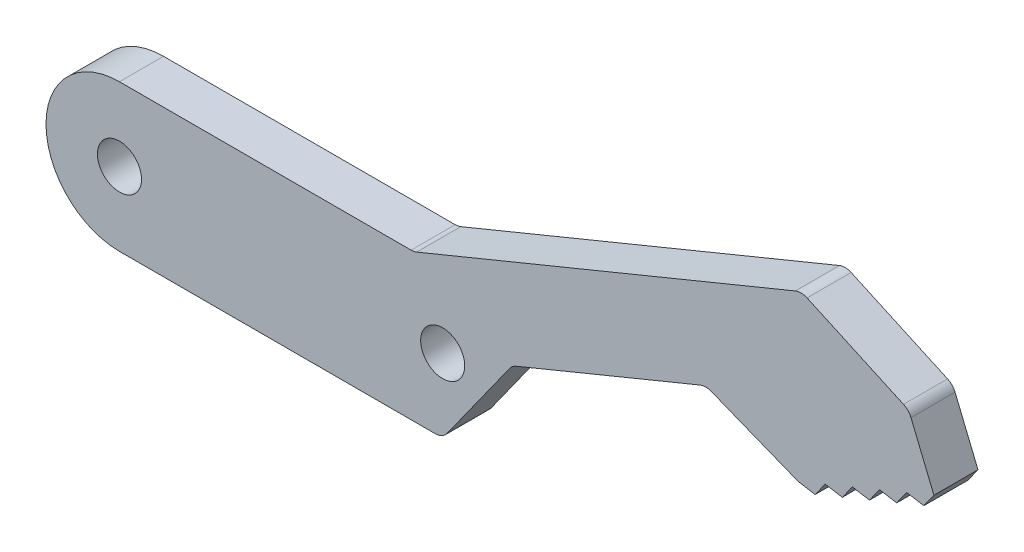
ISO-10303-21;
HEADER;
FILE_DESCRIPTION(('STEP AP214'),'2;1');
FILE_NAME('part.step','',(''),(''),'','','');
FILE_SCHEMA(('AUTOMOTIVE_DESIGN { 1 0 10303 214 1 1 1 1 }'));
ENDSEC;
DATA;
#1=APPLICATION_CONTEXT('core data for automotive mechanical design processes');
#2=APPLICATION_PROTOCOL_DEFINITION('international standard','automotive_design',2000,#1);
#3=PRODUCT_CONTEXT('',#1,'mechanical');
#4=PRODUCT('Part','Part','',(#3));
#5=PRODUCT_RELATED_PRODUCT_CATEGORY('part','',(#4));
#6=PRODUCT_DEFINITION_FORMATION('','',#4);
#7=PRODUCT_DEFINITION_CONTEXT('part definition',#1,'design');
#8=PRODUCT_DEFINITION('design','',#6,#7);
#9=PRODUCT_DEFINITION_SHAPE('','',#8);
#10=(LENGTH_UNIT() NAMED_UNIT(*) SI_UNIT(.MILLI.,.METRE.));
#11=(NAMED_UNIT(*) PLANE_ANGLE_UNIT() SI_UNIT($,.RADIAN.));
#12=(NAMED_UNIT(*) SI_UNIT($,.STERADIAN.) SOLID_ANGLE_UNIT());
#13=UNCERTAINTY_MEASURE_WITH_UNIT(LENGTH_MEASURE(1.E-05),#10,'distance_accuracy_value','');
#14=(GEOMETRIC_REPRESENTATION_CONTEXT(3) GLOBAL_UNCERTAINTY_ASSIGNED_CONTEXT((#13)) GLOBAL_UNIT_ASSIGNED_CONTEXT((#10,
#11,#12)) REPRESENTATION_CONTEXT('',''));
#15=CARTESIAN_POINT('',(0.,0.,0.));
#16=DIRECTION('',(0.,0.,1.));
#17=DIRECTION('',(1.,0.,0.));
#18=AXIS2_PLACEMENT_3D('',#15,#16,#17);
#19=CARTESIAN_POINT('',(7.89764564460258,-4.,3.));
#20=DIRECTION('',(0.,0.,1.));
#21=DIRECTION('',(1.,0.,0.));
#22=AXIS2_PLACEMENT_3D('',#19,#20,#21);
#23=CYLINDRICAL_SURFACE('',#22,1.);
#24=CARTESIAN_POINT('',(7.89764564460258,-4.,3.));
#25=DIRECTION('',(0.,0.,1.));
#26=DIRECTION('',(1.,0.,0.));
#27=AXIS2_PLACEMENT_3D('',#24,#25,#26);
#28=CIRCLE('',#27,1.);
#29=CARTESIAN_POINT('',(7.89764564460258,-5.,3.));
#30=VERTEX_POINT('',#29);
#31=CARTESIAN_POINT('',(8.71134887825418,-4.58128052396835,3.));
#32=VERTEX_POINT('',#31);
#33=EDGE_CURVE('E37',#30,#32,#28,.T.);
#34=ORIENTED_EDGE('',*,*,#33,.F.);
#35=DIRECTION('',(0.,0.,1.));
#36=VECTOR('',#35,1.);
#37=CARTESIAN_POINT('',(7.89764564460258,-5.,3.));
#38=LINE('',#37,#36);
#39=CARTESIAN_POINT('',(7.89764564460258,-5.,0.));
#40=VERTEX_POINT('',#39);
#41=EDGE_CURVE('E454',#40,#30,#38,.T.);
#42=ORIENTED_EDGE('',*,*,#41,.F.);
#43=CARTESIAN_POINT('',(7.89764564460258,-4.,0.));
#44=DIRECTION('',(0.,0.,-1.));
#45=DIRECTION('',(1.,0.,0.));
#46=AXIS2_PLACEMENT_3D('',#43,#44,#45);
#47=CIRCLE('',#46,1.);
#48=CARTESIAN_POINT('',(8.71134887825418,-4.58128052396835,0.));
#49=VERTEX_POINT('',#48);
#50=EDGE_CURVE('E47',#49,#40,#47,.T.);
#51=ORIENTED_EDGE('',*,*,#50,.F.);
#52=DIRECTION('',(0.,0.,-1.));
#53=VECTOR('',#52,1.);
#54=CARTESIAN_POINT('',(8.71134887825418,-4.58128052396835,0.));
#55=LINE('',#54,#53);
#56=EDGE_CURVE('E279',#32,#49,#55,.T.);
#57=ORIENTED_EDGE('',*,*,#56,.F.);
#58=EDGE_LOOP('',(#34,#42,#51,#57));
#59=FACE_BOUND('',#58,.T.);
#60=ADVANCED_FACE('F17',(#59),#23,.T.);
#61=CARTESIAN_POINT('',(13.7885523682827,0.805682858816311,3.));
#62=DIRECTION('',(0.,0.,1.));
#63=DIRECTION('',(1.,0.,0.));
#64=AXIS2_PLACEMENT_3D('',#61,#62,#63);
#65=CYLINDRICAL_SURFACE('',#64,1.);
#66=CARTESIAN_POINT('',(13.7885523682827,0.805682858816311,3.));
#67=DIRECTION('',(0.,0.,-1.));
#68=DIRECTION('',(1.,0.,0.));
#69=AXIS2_PLACEMENT_3D('',#66,#67,#68);
#70=CIRCLE('',#69,1.);
#71=CARTESIAN_POINT('',(12.9748491346311,1.38696338278467,3.));
#72=VERTEX_POINT('',#71);
#73=CARTESIAN_POINT('',(13.4082889555495,1.73056108698286,3.));
#74=VERTEX_POINT('',#73);
#75=EDGE_CURVE('E270',#72,#74,#70,.T.);
#76=ORIENTED_EDGE('',*,*,#75,.F.);
#77=DIRECTION('',(0.,0.,1.));
#78=VECTOR('',#77,1.);
#79=CARTESIAN_POINT('',(12.9748491346311,1.38696338278466,3.));
#80=LINE('',#79,#78);
#81=CARTESIAN_POINT('',(12.9748491346311,1.38696338278467,0.));
#82=VERTEX_POINT('',#81);
#83=EDGE_CURVE('E268',#82,#72,#80,.T.);
#84=ORIENTED_EDGE('',*,*,#83,.F.);
#85=CARTESIAN_POINT('',(13.7885523682827,0.805682858816311,0.));
#86=DIRECTION('',(0.,0.,1.));
#87=DIRECTION('',(1.,0.,0.));
#88=AXIS2_PLACEMENT_3D('',#85,#86,#87);
#89=CIRCLE('',#88,1.);
#90=CARTESIAN_POINT('',(13.4082889555495,1.73056108698286,0.));
#91=VERTEX_POINT('',#90);
#92=EDGE_CURVE('E253',#91,#82,#89,.T.);
#93=ORIENTED_EDGE('',*,*,#92,.F.);
#94=DIRECTION('',(0.,0.,-1.));
#95=VECTOR('',#94,1.);
#96=CARTESIAN_POINT('',(13.4082889555495,1.73056108698286,0.));
#97=LINE('',#96,#95);
#98=EDGE_CURVE('E315',#74,#91,#97,.T.);
#99=ORIENTED_EDGE('',*,*,#98,.F.);
#100=EDGE_LOOP('',(#76,#84,#93,#99));
#101=FACE_BOUND('',#100,.T.);
#102=ADVANCED_FACE('F269',(#101),#65,.F.);
#103=CARTESIAN_POINT('',(26.3189833836422,5.95756590223529,3.));
#104=DIRECTION('',(0.,0.,1.));
#105=DIRECTION('',(1.,0.,0.));
#106=AXIS2_PLACEMENT_3D('',#103,#104,#105);
#107=CYLINDRICAL_SURFACE('',#106,1.);
#108=CARTESIAN_POINT('',(26.3189833836422,5.95756590223529,3.));
#109=DIRECTION('',(0.,0.,-1.));
#110=DIRECTION('',(1.,0.,0.));
#111=AXIS2_PLACEMENT_3D('',#108,#109,#110);
#112=CIRCLE('',#111,1.);
#113=CARTESIAN_POINT('',(25.938719970909,6.88244413040184,3.));
#114=VERTEX_POINT('',#113);
#115=CARTESIAN_POINT('',(26.6879191791018,6.8870207848566,3.));
#116=VERTEX_POINT('',#115);
#117=EDGE_CURVE('E407',#114,#116,#112,.T.);
#118=ORIENTED_EDGE('',*,*,#117,.F.);
#119=DIRECTION('',(0.,0.,1.));
#120=VECTOR('',#119,1.);
#121=CARTESIAN_POINT('',(25.938719970909,6.88244413040184,3.));
#122=LINE('',#121,#120);
#123=CARTESIAN_POINT('',(25.938719970909,6.88244413040184,0.));
#124=VERTEX_POINT('',#123);
#125=EDGE_CURVE('E515',#124,#114,#122,.T.);
#126=ORIENTED_EDGE('',*,*,#125,.F.);
#127=CARTESIAN_POINT('',(26.3189833836422,5.95756590223529,0.));
#128=DIRECTION('',(0.,0.,1.));
#129=DIRECTION('',(1.,0.,0.));
#130=AXIS2_PLACEMENT_3D('',#127,#128,#129);
#131=CIRCLE('',#130,1.);
#132=CARTESIAN_POINT('',(26.6879191791018,6.8870207848566,0.));
#133=VERTEX_POINT('',#132);
#134=EDGE_CURVE('E265',#133,#124,#131,.T.);
#135=ORIENTED_EDGE('',*,*,#134,.F.);
#136=DIRECTION('',(0.,0.,-1.));
#137=VECTOR('',#136,1.);
#138=CARTESIAN_POINT('',(26.6879191791018,6.88702078485661,0.));
#139=LINE('',#138,#137);
#140=EDGE_CURVE('E305',#116,#133,#139,.T.);
#141=ORIENTED_EDGE('',*,*,#140,.F.);
#142=EDGE_LOOP('',(#118,#126,#135,#141));
#143=FACE_BOUND('',#142,.T.);
#144=ADVANCED_FACE('F590',(#143),#107,.F.);
#145=CARTESIAN_POINT('',(6.26467870963807,6.,3.));
#146=DIRECTION('',(0.,0.,1.));
#147=DIRECTION('',(1.,0.,0.));
#148=AXIS2_PLACEMENT_3D('',#145,#146,#147);
#149=CYLINDRICAL_SURFACE('',#148,1.);
#150=CARTESIAN_POINT('',(6.26467870963807,6.,3.));
#151=DIRECTION('',(0.,0.,-1.));
#152=DIRECTION('',(1.,0.,0.));
#153=AXIS2_PLACEMENT_3D('',#150,#151,#152);
#154=CIRCLE('',#153,1.);
#155=CARTESIAN_POINT('',(6.64494212237128,5.07512177183345,3.));
#156=VERTEX_POINT('',#155);
#157=CARTESIAN_POINT('',(6.26467870963807,5.,3.));
#158=VERTEX_POINT('',#157);
#159=EDGE_CURVE('E500',#156,#158,#154,.T.);
#160=ORIENTED_EDGE('',*,*,#159,.F.);
#161=DIRECTION('',(0.,0.,1.));
#162=VECTOR('',#161,1.);
#163=CARTESIAN_POINT('',(6.64494212237128,5.07512177183345,3.));
#164=LINE('',#163,#162);
#165=CARTESIAN_POINT('',(6.64494212237128,5.07512177183345,0.));
#166=VERTEX_POINT('',#165);
#167=EDGE_CURVE('E353',#166,#156,#164,.T.);
#168=ORIENTED_EDGE('',*,*,#167,.F.);
#169=CARTESIAN_POINT('',(6.26467870963807,6.,0.));
#170=DIRECTION('',(0.,0.,1.));
#171=DIRECTION('',(1.,0.,0.));
#172=AXIS2_PLACEMENT_3D('',#169,#170,#171);
#173=CIRCLE('',#172,1.);
#174=CARTESIAN_POINT('',(6.26467870963807,5.,0.));
#175=VERTEX_POINT('',#174);
#176=EDGE_CURVE('E25',#175,#166,#173,.T.);
#177=ORIENTED_EDGE('',*,*,#176,.F.);
#178=DIRECTION('',(0.,0.,-1.));
#179=VECTOR('',#178,1.);
#180=CARTESIAN_POINT('',(6.26467870963807,5.,0.));
#181=LINE('',#180,#179);
#182=EDGE_CURVE('E423',#158,#175,#181,.T.);
#183=ORIENTED_EDGE('',*,*,#182,.F.);
#184=EDGE_LOOP('',(#160,#168,#177,#183));
#185=FACE_BOUND('',#184,.T.);
#186=ADVANCED_FACE('F526',(#185),#149,.F.);
#187=CARTESIAN_POINT('',(32.8009169878943,14.7479197611021,3.));
#188=DIRECTION('',(0.,0.,-1.));
#189=DIRECTION('',(-1.,0.,0.));
#190=AXIS2_PLACEMENT_3D('',#187,#188,#189);
#191=CYLINDRICAL_SURFACE('',#190,1.);
#192=CARTESIAN_POINT('',(32.8009169878943,14.7479197611021,3.));
#193=DIRECTION('',(0.,0.,1.));
#194=DIRECTION('',(1.,0.,0.));
#195=AXIS2_PLACEMENT_3D('',#192,#193,#194);
#196=CIRCLE('',#195,1.);
#197=CARTESIAN_POINT('',(33.2154392478264,15.6579589338968,3.));
#198=VERTEX_POINT('',#197);
#199=CARTESIAN_POINT('',(32.4206535751611,15.6727979892687,3.));
#200=VERTEX_POINT('',#199);
#201=EDGE_CURVE('E492',#198,#200,#196,.T.);
#202=ORIENTED_EDGE('',*,*,#201,.F.);
#203=DIRECTION('',(0.,0.,1.));
#204=VECTOR('',#203,1.);
#205=CARTESIAN_POINT('',(33.2154392478264,15.6579589338968,3.));
#206=LINE('',#205,#204);
#207=CARTESIAN_POINT('',(33.2154392478264,15.6579589338968,0.));
#208=VERTEX_POINT('',#207);
#209=EDGE_CURVE('E292',#208,#198,#206,.T.);
#210=ORIENTED_EDGE('',*,*,#209,.F.);
#211=CARTESIAN_POINT('',(32.8009169878943,14.7479197611021,0.));
#212=DIRECTION('',(0.,0.,-1.));
#213=DIRECTION('',(1.,0.,0.));
#214=AXIS2_PLACEMENT_3D('',#211,#212,#213);
#215=CIRCLE('',#214,1.);
#216=CARTESIAN_POINT('',(32.4206535751611,15.6727979892687,0.));
#217=VERTEX_POINT('',#216);
#218=EDGE_CURVE('E11',#217,#208,#215,.T.);
#219=ORIENTED_EDGE('',*,*,#218,.F.);
#220=DIRECTION('',(0.,0.,-1.));
#221=VECTOR('',#220,1.);
#222=CARTESIAN_POINT('',(32.4206535751611,15.6727979892687,3.));
#223=LINE('',#222,#221);
#224=EDGE_CURVE('E483',#200,#217,#223,.T.);
#225=ORIENTED_EDGE('',*,*,#224,.F.);
#226=EDGE_LOOP('',(#202,#210,#219,#225));
#227=FACE_BOUND('',#226,.T.);
#228=ADVANCED_FACE('F535',(#227),#191,.T.);
#229=CARTESIAN_POINT('',(39.3638437130892,11.7585108441848,3.));
#230=DIRECTION('',(0.,0.,-1.));
#231=DIRECTION('',(-1.,0.,0.));
#232=AXIS2_PLACEMENT_3D('',#229,#230,#231);
#233=CYLINDRICAL_SURFACE('',#232,1.);
#234=CARTESIAN_POINT('',(39.3638437130892,11.7585108441848,3.));
#235=DIRECTION('',(0.,0.,1.));
#236=DIRECTION('',(1.,0.,0.));
#237=AXIS2_PLACEMENT_3D('',#234,#235,#236);
#238=CIRCLE('',#237,1.);
#239=CARTESIAN_POINT('',(40.2887219412557,12.138774256918,3.));
#240=VERTEX_POINT('',#239);
#241=CARTESIAN_POINT('',(39.7783659730213,12.6685500169795,3.));
#242=VERTEX_POINT('',#241);
#243=EDGE_CURVE('E453',#240,#242,#238,.T.);
#244=ORIENTED_EDGE('',*,*,#243,.F.);
#245=DIRECTION('',(0.,0.,1.));
#246=VECTOR('',#245,1.);
#247=CARTESIAN_POINT('',(40.2887219412557,12.138774256918,3.));
#248=LINE('',#247,#246);
#249=CARTESIAN_POINT('',(40.2887219412557,12.138774256918,0.));
#250=VERTEX_POINT('',#249);
#251=EDGE_CURVE('E471',#250,#240,#248,.T.);
#252=ORIENTED_EDGE('',*,*,#251,.F.);
#253=CARTESIAN_POINT('',(39.3638437130892,11.7585108441848,0.));
#254=DIRECTION('',(0.,0.,-1.));
#255=DIRECTION('',(1.,0.,0.));
#256=AXIS2_PLACEMENT_3D('',#253,#254,#255);
#257=CIRCLE('',#256,1.);
#258=CARTESIAN_POINT('',(39.7783659730213,12.6685500169795,0.));
#259=VERTEX_POINT('',#258);
#260=EDGE_CURVE('E404',#259,#250,#257,.T.);
#261=ORIENTED_EDGE('',*,*,#260,.F.);
#262=DIRECTION('',(0.,0.,-1.));
#263=VECTOR('',#262,1.);
#264=CARTESIAN_POINT('',(39.7783659730212,12.6685500169795,3.));
#265=LINE('',#264,#263);
#266=EDGE_CURVE('E385',#242,#259,#265,.T.);
#267=ORIENTED_EDGE('',*,*,#266,.F.);
#268=EDGE_LOOP('',(#244,#252,#261,#267));
#269=FACE_BOUND('',#268,.T.);
#270=ADVANCED_FACE('F540',(#269),#233,.T.);
#271=CARTESIAN_POINT('',(0.,0.,0.));
#272=DIRECTION('',(0.,0.,1.));
#273=DIRECTION('',(1.,0.,0.));
#274=AXIS2_PLACEMENT_3D('',#271,#272,#273);
#275=PLANE('',#274);
#276=CARTESIAN_POINT('',(8.41223064158309,0.,0.));
#277=DIRECTION('',(0.,0.,1.));
#278=DIRECTION('',(1.,0.,0.));
#279=AXIS2_PLACEMENT_3D('',#276,#277,#278);
#280=CIRCLE('',#279,1.5);
#281=CARTESIAN_POINT('',(9.91223064158309,0.,0.));
#282=VERTEX_POINT('',#281);
#283=EDGE_CURVE('E626',#282,#282,#280,.T.);
#284=ORIENTED_EDGE('',*,*,#283,.T.);
#285=EDGE_LOOP('',(#284));
#286=FACE_BOUND('',#285,.T.);
#287=CARTESIAN_POINT('',(-13.5877693584169,0.,0.));
#288=DIRECTION('',(0.,0.,1.));
#289=DIRECTION('',(1.,0.,0.));
#290=AXIS2_PLACEMENT_3D('',#287,#288,#289);
#291=CIRCLE('',#290,1.5);
#292=CARTESIAN_POINT('',(-12.0877693584169,0.,0.));
#293=VERTEX_POINT('',#292);
#294=EDGE_CURVE('E612',#293,#293,#291,.T.);
#295=ORIENTED_EDGE('',*,*,#294,.T.);
#296=EDGE_LOOP('',(#295));
#297=FACE_BOUND('',#296,.T.);
#298=DIRECTION('',(0.910039172794664,-0.414522259932086,0.));
#299=VECTOR('',#298,1.);
#300=CARTESIAN_POINT('',(11.6140411280332,25.4973819323723,0.));
#301=LINE('',#300,#299);
#302=EDGE_CURVE('E477',#208,#259,#301,.T.);
#303=ORIENTED_EDGE('',*,*,#302,.T.);
#304=ORIENTED_EDGE('',*,*,#260,.T.);
#305=DIRECTION('',(0.380263412733207,-0.924878228166549,0.));
#306=VECTOR('',#305,1.);
#307=CARTESIAN_POINT('',(38.7321369055221,15.9247067490612,0.));
#308=LINE('',#307,#306);
#309=CARTESIAN_POINT('',(41.8495009486289,8.34264116979486,0.));
#310=VERTEX_POINT('',#309);
#311=EDGE_CURVE('E468',#250,#310,#308,.T.);
#312=ORIENTED_EDGE('',*,*,#311,.T.);
#313=DIRECTION('',(0.582755963225876,0.812647209633234,0.));
#314=VECTOR('',#313,1.);
#315=CARTESIAN_POINT('',(23.6863552194379,-16.9856791330688,0.));
#316=LINE('',#315,#314);
#317=CARTESIAN_POINT('',(41.1622873534206,7.38432886445756,0.));
#318=VERTEX_POINT('',#317);
#319=EDGE_CURVE('E294',#318,#310,#316,.T.);
#320=ORIENTED_EDGE('',*,*,#319,.F.);
#321=DIRECTION('',(0.985834374567057,-0.167721751487336,0.));
#322=VECTOR('',#321,1.);
#323=CARTESIAN_POINT('',(2.37888752667533,13.9826174973043,0.));
#324=LINE('',#323,#322);
#325=CARTESIAN_POINT('',(39.9997444922958,7.58211434432844,0.));
#326=VERTEX_POINT('',#325);
#327=EDGE_CURVE('E449',#326,#318,#324,.T.);
#328=ORIENTED_EDGE('',*,*,#327,.F.);
#329=DIRECTION('',(0.582755963225879,0.812647209633232,0.));
#330=VECTOR('',#329,1.);
#331=CARTESIAN_POINT('',(22.8249509000335,-16.3679590474883,0.));
#332=LINE('',#331,#330);
#333=CARTESIAN_POINT('',(39.3125308970875,6.62380203899114,0.));
#334=VERTEX_POINT('',#333);
#335=EDGE_CURVE('E434',#334,#326,#332,.T.);
#336=ORIENTED_EDGE('',*,*,#335,.F.);
#337=DIRECTION('',(0.985834374567056,-0.167721751487343,0.));
#338=VECTOR('',#337,1.);
#339=CARTESIAN_POINT('',(2.20110282566793,12.937635150226,0.));
#340=LINE('',#339,#338);
#341=CARTESIAN_POINT('',(38.1499880359627,6.82158751886202,0.));
#342=VERTEX_POINT('',#341);
#343=EDGE_CURVE('E337',#342,#334,#340,.T.);
#344=ORIENTED_EDGE('',*,*,#343,.F.);
#345=DIRECTION('',(0.582755963225876,0.812647209633234,0.));
#346=VECTOR('',#345,1.);
#347=CARTESIAN_POINT('',(21.9635465806293,-15.7502389619078,0.));
#348=LINE('',#347,#346);
#349=CARTESIAN_POINT('',(37.4627744407544,5.86327521352473,0.));
#350=VERTEX_POINT('',#349);
#351=EDGE_CURVE('E376',#350,#342,#348,.T.);
#352=ORIENTED_EDGE('',*,*,#351,.F.);
#353=DIRECTION('',(0.985834374567056,-0.167721751487343,0.));
#354=VECTOR('',#353,1.);
#355=CARTESIAN_POINT('',(2.0233181246604,11.8926528031476,0.));
#356=LINE('',#355,#354);
#357=CARTESIAN_POINT('',(36.3002315796296,6.06106069339561,0.));
#358=VERTEX_POINT('',#357);
#359=EDGE_CURVE('E299',#358,#350,#356,.T.);
#360=ORIENTED_EDGE('',*,*,#359,.F.);
#361=DIRECTION('',(0.582755963225863,0.812647209633244,0.));
#362=VECTOR('',#361,1.);
#363=CARTESIAN_POINT('',(21.1021422612256,-15.1325188763272,0.));
#364=LINE('',#363,#362);
#365=CARTESIAN_POINT('',(35.6130179844213,5.10274838805832,0.));
#366=VERTEX_POINT('',#365);
#367=EDGE_CURVE('E390',#366,#358,#364,.T.);
#368=ORIENTED_EDGE('',*,*,#367,.F.);
#369=DIRECTION('',(0.985834374567056,-0.167721751487343,0.));
#370=VECTOR('',#369,1.);
#371=CARTESIAN_POINT('',(1.84553342365287,10.8476704560691,0.));
#372=LINE('',#371,#370);
#373=CARTESIAN_POINT('',(34.4504751232965,5.30053386792921,0.));
#374=VERTEX_POINT('',#373);
#375=EDGE_CURVE('E365',#374,#366,#372,.T.);
#376=ORIENTED_EDGE('',*,*,#375,.F.);
#377=DIRECTION('',(0.582755963225875,0.812647209633235,0.));
#378=VECTOR('',#377,1.);
#379=CARTESIAN_POINT('',(20.2407379418208,-14.5147987907469,0.));
#380=LINE('',#379,#378);
#381=CARTESIAN_POINT('',(33.7632615280882,4.34222156259191,0.));
#382=VERTEX_POINT('',#381);
#383=EDGE_CURVE('E324',#382,#374,#380,.T.);
#384=ORIENTED_EDGE('',*,*,#383,.F.);
#385=DIRECTION('',(0.985834374567056,-0.167721751487343,0.));
#386=VECTOR('',#385,1.);
#387=CARTESIAN_POINT('',(1.66774872264532,9.80268810899064,0.));
#388=LINE('',#387,#386);
#389=CARTESIAN_POINT('',(32.6007186669634,4.54000704246279,0.));
#390=VERTEX_POINT('',#389);
#391=EDGE_CURVE('E341',#390,#382,#388,.T.);
#392=ORIENTED_EDGE('',*,*,#391,.F.);
#393=DIRECTION('',(-0.929454882621317,0.368935795459582,0.));
#394=VECTOR('',#393,1.);
#395=CARTESIAN_POINT('',(5.99421194662055,15.1011358339824,0.));
#396=LINE('',#395,#394);
#397=EDGE_CURVE('E309',#390,#133,#396,.T.);
#398=ORIENTED_EDGE('',*,*,#397,.T.);
#399=ORIENTED_EDGE('',*,*,#134,.T.);
#400=DIRECTION('',(-0.924878228166549,-0.380263412733207,0.));
#401=VECTOR('',#400,1.);
#402=CARTESIAN_POINT('',(1.33020835946708,-3.23533821398539,0.));
#403=LINE('',#402,#401);
#404=EDGE_CURVE('E260',#124,#91,#403,.T.);
#405=ORIENTED_EDGE('',*,*,#404,.T.);
#406=ORIENTED_EDGE('',*,*,#92,.T.);
#407=DIRECTION('',(-0.581280523968354,-0.813703233651604,0.));
#408=VECTOR('',#407,1.);
#409=CARTESIAN_POINT('',(7.93479607689038,-5.66833487985339,0.));
#410=LINE('',#409,#408);
#411=EDGE_CURVE('E258',#82,#49,#410,.T.);
#412=ORIENTED_EDGE('',*,*,#411,.T.);
#413=ORIENTED_EDGE('',*,*,#50,.T.);
#414=DIRECTION('',(1.,0.,0.));
#415=VECTOR('',#414,1.);
#416=CARTESIAN_POINT('',(0.,-5.,0.));
#417=LINE('',#416,#415);
#418=CARTESIAN_POINT('',(-13.5877693584169,-5.,0.));
#419=VERTEX_POINT('',#418);
#420=EDGE_CURVE('E493',#419,#40,#417,.T.);
#421=ORIENTED_EDGE('',*,*,#420,.F.);
#422=CARTESIAN_POINT('',(-13.5877693584169,0.,0.));
#423=DIRECTION('',(0.,0.,1.));
#424=DIRECTION('',(1.,0.,0.));
#425=AXIS2_PLACEMENT_3D('',#422,#423,#424);
#426=CIRCLE('',#425,5.);
#427=CARTESIAN_POINT('',(-13.5877693584169,5.,0.));
#428=VERTEX_POINT('',#427);
#429=EDGE_CURVE('E288',#428,#419,#426,.T.);
#430=ORIENTED_EDGE('',*,*,#429,.F.);
#431=DIRECTION('',(1.,0.,0.));
#432=VECTOR('',#431,1.);
#433=CARTESIAN_POINT('',(0.,5.,0.));
#434=LINE('',#433,#432);
#435=EDGE_CURVE('E427',#428,#175,#434,.T.);
#436=ORIENTED_EDGE('',*,*,#435,.T.);
#437=ORIENTED_EDGE('',*,*,#176,.T.);
#438=DIRECTION('',(0.924878228166549,0.380263412733207,0.));
#439=VECTOR('',#438,1.);
#440=CARTESIAN_POINT('',(-0.824046506276309,2.00424928386783,0.));
#441=LINE('',#440,#439);
#442=EDGE_CURVE('E358',#166,#217,#441,.T.);
#443=ORIENTED_EDGE('',*,*,#442,.T.);
#444=ORIENTED_EDGE('',*,*,#218,.T.);
#445=EDGE_LOOP('',(#303,#304,#312,#320,#328,#336,#344,#352,#360,#368,#376,#384,#392,#398,#399,
#405,#406,#412,#413,#421,#430,#436,#437,#443,#444));
#446=FACE_BOUND('',#445,.T.);
#447=ADVANCED_FACE('F256',(#286,#297,#446),#275,.F.);
#448=CARTESIAN_POINT('',(0.,0.,3.));
#449=DIRECTION('',(0.,0.,1.));
#450=DIRECTION('',(1.,0.,0.));
#451=AXIS2_PLACEMENT_3D('',#448,#449,#450);
#452=PLANE('',#451);
#453=CARTESIAN_POINT('',(8.41223064158309,0.,3.));
#454=DIRECTION('',(0.,0.,1.));
#455=DIRECTION('',(1.,0.,0.));
#456=AXIS2_PLACEMENT_3D('',#453,#454,#455);
#457=CIRCLE('',#456,1.5);
#458=CARTESIAN_POINT('',(9.91223064158309,0.,3.));
#459=VERTEX_POINT('',#458);
#460=EDGE_CURVE('E615',#459,#459,#457,.T.);
#461=ORIENTED_EDGE('',*,*,#460,.F.);
#462=EDGE_LOOP('',(#461));
#463=FACE_BOUND('',#462,.T.);
#464=CARTESIAN_POINT('',(-13.5877693584169,0.,3.));
#465=DIRECTION('',(0.,0.,1.));
#466=DIRECTION('',(1.,0.,0.));
#467=AXIS2_PLACEMENT_3D('',#464,#465,#466);
#468=CIRCLE('',#467,1.5);
#469=CARTESIAN_POINT('',(-12.0877693584169,0.,3.));
#470=VERTEX_POINT('',#469);
#471=EDGE_CURVE('E602',#470,#470,#468,.T.);
#472=ORIENTED_EDGE('',*,*,#471,.F.);
#473=EDGE_LOOP('',(#472));
#474=FACE_BOUND('',#473,.T.);
#475=DIRECTION('',(0.380263412733207,-0.924878228166549,0.));
#476=VECTOR('',#475,1.);
#477=CARTESIAN_POINT('',(38.7321369055221,15.9247067490612,3.));
#478=LINE('',#477,#476);
#479=CARTESIAN_POINT('',(41.8495009486289,8.34264116979486,3.));
#480=VERTEX_POINT('',#479);
#481=EDGE_CURVE('E386',#240,#480,#478,.T.);
#482=ORIENTED_EDGE('',*,*,#481,.F.);
#483=ORIENTED_EDGE('',*,*,#243,.T.);
#484=DIRECTION('',(0.910039172794664,-0.414522259932086,0.));
#485=VECTOR('',#484,1.);
#486=CARTESIAN_POINT('',(11.6140411280332,25.4973819323723,3.));
#487=LINE('',#486,#485);
#488=EDGE_CURVE('E381',#198,#242,#487,.T.);
#489=ORIENTED_EDGE('',*,*,#488,.F.);
#490=ORIENTED_EDGE('',*,*,#201,.T.);
#491=DIRECTION('',(0.924878228166549,0.380263412733207,0.));
#492=VECTOR('',#491,1.);
#493=CARTESIAN_POINT('',(-0.824046506276309,2.00424928386783,3.));
#494=LINE('',#493,#492);
#495=EDGE_CURVE('E486',#156,#200,#494,.T.);
#496=ORIENTED_EDGE('',*,*,#495,.F.);
#497=ORIENTED_EDGE('',*,*,#159,.T.);
#498=DIRECTION('',(1.,0.,0.));
#499=VECTOR('',#498,1.);
#500=CARTESIAN_POINT('',(0.,5.,3.));
#501=LINE('',#500,#499);
#502=CARTESIAN_POINT('',(-13.5877693584169,5.,3.));
#503=VERTEX_POINT('',#502);
#504=EDGE_CURVE('E357',#503,#158,#501,.T.);
#505=ORIENTED_EDGE('',*,*,#504,.F.);
#506=CARTESIAN_POINT('',(-13.5877693584169,0.,3.));
#507=DIRECTION('',(0.,0.,1.));
#508=DIRECTION('',(1.,0.,0.));
#509=AXIS2_PLACEMENT_3D('',#506,#507,#508);
#510=CIRCLE('',#509,5.);
#511=CARTESIAN_POINT('',(-13.5877693584169,-5.,3.));
#512=VERTEX_POINT('',#511);
#513=EDGE_CURVE('E618',#503,#512,#510,.T.);
#514=ORIENTED_EDGE('',*,*,#513,.T.);
#515=DIRECTION('',(1.,0.,0.));
#516=VECTOR('',#515,1.);
#517=CARTESIAN_POINT('',(0.,-5.,3.));
#518=LINE('',#517,#516);
#519=EDGE_CURVE('E450',#512,#30,#518,.T.);
#520=ORIENTED_EDGE('',*,*,#519,.T.);
#521=ORIENTED_EDGE('',*,*,#33,.T.);
#522=DIRECTION('',(-0.581280523968354,-0.813703233651604,0.));
#523=VECTOR('',#522,1.);
#524=CARTESIAN_POINT('',(7.93479607689038,-5.66833487985339,3.));
#525=LINE('',#524,#523);
#526=EDGE_CURVE('E275',#72,#32,#525,.T.);
#527=ORIENTED_EDGE('',*,*,#526,.F.);
#528=ORIENTED_EDGE('',*,*,#75,.T.);
#529=DIRECTION('',(-0.924878228166549,-0.380263412733207,0.));
#530=VECTOR('',#529,1.);
#531=CARTESIAN_POINT('',(1.33020835946708,-3.23533821398539,3.));
#532=LINE('',#531,#530);
#533=EDGE_CURVE('E318',#114,#74,#532,.T.);
#534=ORIENTED_EDGE('',*,*,#533,.F.);
#535=ORIENTED_EDGE('',*,*,#117,.T.);
#536=DIRECTION('',(-0.929454882621317,0.368935795459582,0.));
#537=VECTOR('',#536,1.);
#538=CARTESIAN_POINT('',(5.99421194662055,15.1011358339824,3.));
#539=LINE('',#538,#537);
#540=CARTESIAN_POINT('',(32.6007186669634,4.54000704246279,3.));
#541=VERTEX_POINT('',#540);
#542=EDGE_CURVE('E310',#541,#116,#539,.T.);
#543=ORIENTED_EDGE('',*,*,#542,.F.);
#544=DIRECTION('',(0.985834374567056,-0.167721751487343,0.));
#545=VECTOR('',#544,1.);
#546=CARTESIAN_POINT('',(1.66774872264532,9.80268810899064,3.));
#547=LINE('',#546,#545);
#548=CARTESIAN_POINT('',(33.7632615280882,4.34222156259191,3.));
#549=VERTEX_POINT('',#548);
#550=EDGE_CURVE('E349',#541,#549,#547,.T.);
#551=ORIENTED_EDGE('',*,*,#550,.T.);
#552=DIRECTION('',(0.582755963225875,0.812647209633235,0.));
#553=VECTOR('',#552,1.);
#554=CARTESIAN_POINT('',(20.2407379418208,-14.5147987907469,3.));
#555=LINE('',#554,#553);
#556=CARTESIAN_POINT('',(34.4504751232965,5.30053386792921,3.));
#557=VERTEX_POINT('',#556);
#558=EDGE_CURVE('E323',#549,#557,#555,.T.);
#559=ORIENTED_EDGE('',*,*,#558,.T.);
#560=DIRECTION('',(0.985834374567056,-0.167721751487343,0.));
#561=VECTOR('',#560,1.);
#562=CARTESIAN_POINT('',(1.84553342365287,10.8476704560691,3.));
#563=LINE('',#562,#561);
#564=CARTESIAN_POINT('',(35.6130179844213,5.10274838805832,3.));
#565=VERTEX_POINT('',#564);
#566=EDGE_CURVE('E379',#557,#565,#563,.T.);
#567=ORIENTED_EDGE('',*,*,#566,.T.);
#568=DIRECTION('',(0.582755963225863,0.812647209633244,0.));
#569=VECTOR('',#568,1.);
#570=CARTESIAN_POINT('',(21.1021422612256,-15.1325188763272,3.));
#571=LINE('',#570,#569);
#572=CARTESIAN_POINT('',(36.3002315796296,6.06106069339561,3.));
#573=VERTEX_POINT('',#572);
#574=EDGE_CURVE('E304',#565,#573,#571,.T.);
#575=ORIENTED_EDGE('',*,*,#574,.T.);
#576=DIRECTION('',(0.985834374567056,-0.167721751487343,0.));
#577=VECTOR('',#576,1.);
#578=CARTESIAN_POINT('',(2.0233181246604,11.8926528031476,3.));
#579=LINE('',#578,#577);
#580=CARTESIAN_POINT('',(37.4627744407544,5.86327521352473,3.));
#581=VERTEX_POINT('',#580);
#582=EDGE_CURVE('E372',#573,#581,#579,.T.);
#583=ORIENTED_EDGE('',*,*,#582,.T.);
#584=DIRECTION('',(0.582755963225876,0.812647209633234,0.));
#585=VECTOR('',#584,1.);
#586=CARTESIAN_POINT('',(21.9635465806293,-15.7502389619078,3.));
#587=LINE('',#586,#585);
#588=CARTESIAN_POINT('',(38.1499880359627,6.82158751886202,3.));
#589=VERTEX_POINT('',#588);
#590=EDGE_CURVE('E417',#581,#589,#587,.T.);
#591=ORIENTED_EDGE('',*,*,#590,.T.);
#592=DIRECTION('',(0.985834374567056,-0.167721751487343,0.));
#593=VECTOR('',#592,1.);
#594=CARTESIAN_POINT('',(2.20110282566793,12.937635150226,3.));
#595=LINE('',#594,#593);
#596=CARTESIAN_POINT('',(39.3125308970875,6.62380203899114,3.));
#597=VERTEX_POINT('',#596);
#598=EDGE_CURVE('E336',#589,#597,#595,.T.);
#599=ORIENTED_EDGE('',*,*,#598,.T.);
#600=DIRECTION('',(0.582755963225879,0.812647209633232,0.));
#601=VECTOR('',#600,1.);
#602=CARTESIAN_POINT('',(22.8249509000335,-16.3679590474883,3.));
#603=LINE('',#602,#601);
#604=CARTESIAN_POINT('',(39.9997444922958,7.58211434432844,3.));
#605=VERTEX_POINT('',#604);
#606=EDGE_CURVE('E445',#597,#605,#603,.T.);
#607=ORIENTED_EDGE('',*,*,#606,.T.);
#608=DIRECTION('',(0.985834374567057,-0.167721751487336,0.));
#609=VECTOR('',#608,1.);
#610=CARTESIAN_POINT('',(2.37888752667533,13.9826174973043,3.));
#611=LINE('',#610,#609);
#612=CARTESIAN_POINT('',(41.1622873534206,7.38432886445756,3.));
#613=VERTEX_POINT('',#612);
#614=EDGE_CURVE('E298',#605,#613,#611,.T.);
#615=ORIENTED_EDGE('',*,*,#614,.T.);
#616=DIRECTION('',(0.582755963225876,0.812647209633234,0.));
#617=VECTOR('',#616,1.);
#618=CARTESIAN_POINT('',(23.6863552194379,-16.9856791330688,3.));
#619=LINE('',#618,#617);
#620=EDGE_CURVE('E394',#613,#480,#619,.T.);
#621=ORIENTED_EDGE('',*,*,#620,.T.);
#622=EDGE_LOOP('',(#482,#483,#489,#490,#496,#497,#505,#514,#520,#521,#527,#528,#534,#535,#543,
#551,#559,#567,#575,#583,#591,#599,#607,#615,#621));
#623=FACE_BOUND('',#622,.T.);
#624=ADVANCED_FACE('F637',(#463,#474,#623),#452,.T.);
#625=CARTESIAN_POINT('',(0.,-5.,3.));
#626=DIRECTION('',(0.,1.,0.));
#627=DIRECTION('',(1.,0.,0.));
#628=AXIS2_PLACEMENT_3D('',#625,#626,#627);
#629=PLANE('',#628);
#630=ORIENTED_EDGE('',*,*,#420,.T.);
#631=ORIENTED_EDGE('',*,*,#41,.T.);
#632=ORIENTED_EDGE('',*,*,#519,.F.);
#633=DIRECTION('',(0.,0.,-1.));
#634=VECTOR('',#633,1.);
#635=CARTESIAN_POINT('',(-13.5877693584169,-5.,3.));
#636=LINE('',#635,#634);
#637=EDGE_CURVE('E281',#512,#419,#636,.T.);
#638=ORIENTED_EDGE('',*,*,#637,.T.);
#639=EDGE_LOOP('',(#630,#631,#632,#638));
#640=FACE_BOUND('',#639,.T.);
#641=ADVANCED_FACE('F639',(#640),#629,.F.);
#642=CARTESIAN_POINT('',(0.,5.,3.));
#643=DIRECTION('',(0.,1.,0.));
#644=DIRECTION('',(1.,0.,0.));
#645=AXIS2_PLACEMENT_3D('',#642,#643,#644);
#646=PLANE('',#645);
#647=ORIENTED_EDGE('',*,*,#504,.T.);
#648=ORIENTED_EDGE('',*,*,#182,.T.);
#649=ORIENTED_EDGE('',*,*,#435,.F.);
#650=DIRECTION('',(0.,0.,-1.));
#651=VECTOR('',#650,1.);
#652=CARTESIAN_POINT('',(-13.5877693584169,5.,3.));
#653=LINE('',#652,#651);
#654=EDGE_CURVE('E616',#503,#428,#653,.T.);
#655=ORIENTED_EDGE('',*,*,#654,.F.);
#656=EDGE_LOOP('',(#647,#648,#649,#655));
#657=FACE_BOUND('',#656,.T.);
#658=ADVANCED_FACE('F524',(#657),#646,.T.);
#659=CARTESIAN_POINT('',(-0.824046506276309,2.00424928386783,3.));
#660=DIRECTION('',(-0.380263412733207,0.924878228166549,0.));
#661=DIRECTION('',(0.,0.,1.));
#662=AXIS2_PLACEMENT_3D('',#659,#660,#661);
#663=PLANE('',#662);
#664=ORIENTED_EDGE('',*,*,#495,.T.);
#665=ORIENTED_EDGE('',*,*,#224,.T.);
#666=ORIENTED_EDGE('',*,*,#442,.F.);
#667=ORIENTED_EDGE('',*,*,#167,.T.);
#668=EDGE_LOOP('',(#664,#665,#666,#667));
#669=FACE_BOUND('',#668,.T.);
#670=ADVANCED_FACE('F530',(#669),#663,.T.);
#671=CARTESIAN_POINT('',(11.6140411280332,25.4973819323723,3.));
#672=DIRECTION('',(0.414522259932086,0.910039172794664,0.));
#673=DIRECTION('',(0.,0.,-1.));
#674=AXIS2_PLACEMENT_3D('',#671,#672,#673);
#675=PLANE('',#674);
#676=ORIENTED_EDGE('',*,*,#488,.T.);
#677=ORIENTED_EDGE('',*,*,#266,.T.);
#678=ORIENTED_EDGE('',*,*,#302,.F.);
#679=ORIENTED_EDGE('',*,*,#209,.T.);
#680=EDGE_LOOP('',(#676,#677,#678,#679));
#681=FACE_BOUND('',#680,.T.);
#682=ADVANCED_FACE('F537',(#681),#675,.T.);
#683=CARTESIAN_POINT('',(38.7321369055221,15.9247067490612,3.));
#684=DIRECTION('',(0.924878228166549,0.380263412733207,0.));
#685=DIRECTION('',(0.,0.,-1.));
#686=AXIS2_PLACEMENT_3D('',#683,#684,#685);
#687=PLANE('',#686);
#688=ORIENTED_EDGE('',*,*,#311,.F.);
#689=ORIENTED_EDGE('',*,*,#251,.T.);
#690=ORIENTED_EDGE('',*,*,#481,.T.);
#691=DIRECTION('',(0.,0.,-1.));
#692=VECTOR('',#691,1.);
#693=CARTESIAN_POINT('',(41.8495009486289,8.34264116979486,3.));
#694=LINE('',#693,#692);
#695=EDGE_CURVE('E297',#480,#310,#694,.T.);
#696=ORIENTED_EDGE('',*,*,#695,.T.);
#697=EDGE_LOOP('',(#688,#689,#690,#696));
#698=FACE_BOUND('',#697,.T.);
#699=ADVANCED_FACE('F547',(#698),#687,.T.);
#700=CARTESIAN_POINT('',(23.6863552194379,-16.9856791330688,3.));
#701=DIRECTION('',(-0.812647209633234,0.582755963225876,0.));
#702=DIRECTION('',(0.,0.,1.));
#703=AXIS2_PLACEMENT_3D('',#700,#701,#702);
#704=PLANE('',#703);
#705=ORIENTED_EDGE('',*,*,#319,.T.);
#706=ORIENTED_EDGE('',*,*,#695,.F.);
#707=ORIENTED_EDGE('',*,*,#620,.F.);
#708=DIRECTION('',(0.,0.,-1.));
#709=VECTOR('',#708,1.);
#710=CARTESIAN_POINT('',(41.1622873534206,7.38432886445756,3.));
#711=LINE('',#710,#709);
#712=EDGE_CURVE('E458',#613,#318,#711,.T.);
#713=ORIENTED_EDGE('',*,*,#712,.T.);
#714=EDGE_LOOP('',(#705,#706,#707,#713));
#715=FACE_BOUND('',#714,.T.);
#716=ADVANCED_FACE('F549',(#715),#704,.F.);
#717=CARTESIAN_POINT('',(2.37888752667533,13.9826174973043,3.));
#718=DIRECTION('',(0.167721751487336,0.985834374567057,0.));
#719=DIRECTION('',(0.,0.,-1.));
#720=AXIS2_PLACEMENT_3D('',#717,#718,#719);
#721=PLANE('',#720);
#722=ORIENTED_EDGE('',*,*,#327,.T.);
#723=ORIENTED_EDGE('',*,*,#712,.F.);
#724=ORIENTED_EDGE('',*,*,#614,.F.);
#725=DIRECTION('',(0.,0.,-1.));
#726=VECTOR('',#725,1.);
#727=CARTESIAN_POINT('',(39.9997444922958,7.58211434432844,3.));
#728=LINE('',#727,#726);
#729=EDGE_CURVE('E441',#605,#326,#728,.T.);
#730=ORIENTED_EDGE('',*,*,#729,.T.);
#731=EDGE_LOOP('',(#722,#723,#724,#730));
#732=FACE_BOUND('',#731,.T.);
#733=ADVANCED_FACE('F552',(#732),#721,.F.);
#734=CARTESIAN_POINT('',(22.8249509000335,-16.3679590474883,3.));
#735=DIRECTION('',(-0.812647209633232,0.582755963225879,0.));
#736=DIRECTION('',(0.,0.,1.));
#737=AXIS2_PLACEMENT_3D('',#734,#735,#736);
#738=PLANE('',#737);
#739=ORIENTED_EDGE('',*,*,#335,.T.);
#740=ORIENTED_EDGE('',*,*,#729,.F.);
#741=ORIENTED_EDGE('',*,*,#606,.F.);
#742=DIRECTION('',(0.,0.,-1.));
#743=VECTOR('',#742,1.);
#744=CARTESIAN_POINT('',(39.3125308970875,6.62380203899114,3.));
#745=LINE('',#744,#743);
#746=EDGE_CURVE('E332',#597,#334,#745,.T.);
#747=ORIENTED_EDGE('',*,*,#746,.T.);
#748=EDGE_LOOP('',(#739,#740,#741,#747));
#749=FACE_BOUND('',#748,.T.);
#750=ADVANCED_FACE('F556',(#749),#738,.F.);
#751=CARTESIAN_POINT('',(2.20110282566793,12.937635150226,3.));
#752=DIRECTION('',(0.167721751487343,0.985834374567056,0.));
#753=DIRECTION('',(0.,0.,-1.));
#754=AXIS2_PLACEMENT_3D('',#751,#752,#753);
#755=PLANE('',#754);
#756=ORIENTED_EDGE('',*,*,#343,.T.);
#757=ORIENTED_EDGE('',*,*,#746,.F.);
#758=ORIENTED_EDGE('',*,*,#598,.F.);
#759=DIRECTION('',(0.,0.,-1.));
#760=VECTOR('',#759,1.);
#761=CARTESIAN_POINT('',(38.1499880359627,6.82158751886202,3.));
#762=LINE('',#761,#760);
#763=EDGE_CURVE('E411',#589,#342,#762,.T.);
#764=ORIENTED_EDGE('',*,*,#763,.T.);
#765=EDGE_LOOP('',(#756,#757,#758,#764));
#766=FACE_BOUND('',#765,.T.);
#767=ADVANCED_FACE('F558',(#766),#755,.F.);
#768=CARTESIAN_POINT('',(21.9635465806293,-15.7502389619078,3.));
#769=DIRECTION('',(-0.812647209633234,0.582755963225876,0.));
#770=DIRECTION('',(0.,0.,1.));
#771=AXIS2_PLACEMENT_3D('',#768,#769,#770);
#772=PLANE('',#771);
#773=ORIENTED_EDGE('',*,*,#351,.T.);
#774=ORIENTED_EDGE('',*,*,#763,.F.);
#775=ORIENTED_EDGE('',*,*,#590,.F.);
#776=DIRECTION('',(0.,0.,-1.));
#777=VECTOR('',#776,1.);
#778=CARTESIAN_POINT('',(37.4627744407544,5.86327521352473,3.));
#779=LINE('',#778,#777);
#780=EDGE_CURVE('E303',#581,#350,#779,.T.);
#781=ORIENTED_EDGE('',*,*,#780,.T.);
#782=EDGE_LOOP('',(#773,#774,#775,#781));
#783=FACE_BOUND('',#782,.T.);
#784=ADVANCED_FACE('F561',(#783),#772,.F.);
#785=CARTESIAN_POINT('',(2.0233181246604,11.8926528031476,3.));
#786=DIRECTION('',(0.167721751487343,0.985834374567056,0.));
#787=DIRECTION('',(0.,0.,-1.));
#788=AXIS2_PLACEMENT_3D('',#785,#786,#787);
#789=PLANE('',#788);
#790=ORIENTED_EDGE('',*,*,#359,.T.);
#791=ORIENTED_EDGE('',*,*,#780,.F.);
#792=ORIENTED_EDGE('',*,*,#582,.F.);
#793=DIRECTION('',(0.,0.,-1.));
#794=VECTOR('',#793,1.);
#795=CARTESIAN_POINT('',(36.3002315796296,6.06106069339561,3.));
#796=LINE('',#795,#794);
#797=EDGE_CURVE('E398',#573,#358,#796,.T.);
#798=ORIENTED_EDGE('',*,*,#797,.T.);
#799=EDGE_LOOP('',(#790,#791,#792,#798));
#800=FACE_BOUND('',#799,.T.);
#801=ADVANCED_FACE('F566',(#800),#789,.F.);
#802=CARTESIAN_POINT('',(21.1021422612256,-15.1325188763272,3.));
#803=DIRECTION('',(-0.812647209633244,0.582755963225863,0.));
#804=DIRECTION('',(0.,0.,1.));
#805=AXIS2_PLACEMENT_3D('',#802,#803,#804);
#806=PLANE('',#805);
#807=ORIENTED_EDGE('',*,*,#367,.T.);
#808=ORIENTED_EDGE('',*,*,#797,.F.);
#809=ORIENTED_EDGE('',*,*,#574,.F.);
#810=DIRECTION('',(0.,0.,-1.));
#811=VECTOR('',#810,1.);
#812=CARTESIAN_POINT('',(35.6130179844213,5.10274838805832,3.));
#813=LINE('',#812,#811);
#814=EDGE_CURVE('E371',#565,#366,#813,.T.);
#815=ORIENTED_EDGE('',*,*,#814,.T.);
#816=EDGE_LOOP('',(#807,#808,#809,#815));
#817=FACE_BOUND('',#816,.T.);
#818=ADVANCED_FACE('F571',(#817),#806,.F.);
#819=CARTESIAN_POINT('',(1.84553342365287,10.8476704560691,3.));
#820=DIRECTION('',(0.167721751487343,0.985834374567056,0.));
#821=DIRECTION('',(0.,0.,-1.));
#822=AXIS2_PLACEMENT_3D('',#819,#820,#821);
#823=PLANE('',#822);
#824=ORIENTED_EDGE('',*,*,#375,.T.);
#825=ORIENTED_EDGE('',*,*,#814,.F.);
#826=ORIENTED_EDGE('',*,*,#566,.F.);
#827=DIRECTION('',(0.,0.,-1.));
#828=VECTOR('',#827,1.);
#829=CARTESIAN_POINT('',(34.4504751232965,5.30053386792921,3.));
#830=LINE('',#829,#828);
#831=EDGE_CURVE('E319',#557,#374,#830,.T.);
#832=ORIENTED_EDGE('',*,*,#831,.T.);
#833=EDGE_LOOP('',(#824,#825,#826,#832));
#834=FACE_BOUND('',#833,.T.);
#835=ADVANCED_FACE('F574',(#834),#823,.F.);
#836=CARTESIAN_POINT('',(20.2407379418208,-14.5147987907469,3.));
#837=DIRECTION('',(-0.812647209633235,0.582755963225875,0.));
#838=DIRECTION('',(0.,0.,1.));
#839=AXIS2_PLACEMENT_3D('',#836,#837,#838);
#840=PLANE('',#839);
#841=ORIENTED_EDGE('',*,*,#383,.T.);
#842=ORIENTED_EDGE('',*,*,#831,.F.);
#843=ORIENTED_EDGE('',*,*,#558,.F.);
#844=DIRECTION('',(0.,0.,-1.));
#845=VECTOR('',#844,1.);
#846=CARTESIAN_POINT('',(33.7632615280882,4.34222156259191,3.));
#847=LINE('',#846,#845);
#848=EDGE_CURVE('E345',#549,#382,#847,.T.);
#849=ORIENTED_EDGE('',*,*,#848,.T.);
#850=EDGE_LOOP('',(#841,#842,#843,#849));
#851=FACE_BOUND('',#850,.T.);
#852=ADVANCED_FACE('F578',(#851),#840,.F.);
#853=CARTESIAN_POINT('',(1.66774872264532,9.80268810899064,3.));
#854=DIRECTION('',(0.167721751487343,0.985834374567056,0.));
#855=DIRECTION('',(0.,0.,-1.));
#856=AXIS2_PLACEMENT_3D('',#853,#854,#855);
#857=PLANE('',#856);
#858=ORIENTED_EDGE('',*,*,#391,.T.);
#859=ORIENTED_EDGE('',*,*,#848,.F.);
#860=ORIENTED_EDGE('',*,*,#550,.F.);
#861=DIRECTION('',(0.,0.,-1.));
#862=VECTOR('',#861,1.);
#863=CARTESIAN_POINT('',(32.6007186669634,4.54000704246279,3.));
#864=LINE('',#863,#862);
#865=EDGE_CURVE('E331',#541,#390,#864,.T.);
#866=ORIENTED_EDGE('',*,*,#865,.T.);
#867=EDGE_LOOP('',(#858,#859,#860,#866));
#868=FACE_BOUND('',#867,.T.);
#869=ADVANCED_FACE('F580',(#868),#857,.F.);
#870=CARTESIAN_POINT('',(5.99421194662055,15.1011358339824,3.));
#871=DIRECTION('',(-0.368935795459582,-0.929454882621317,0.));
#872=DIRECTION('',(-0.929454882621317,0.368935795459582,0.));
#873=AXIS2_PLACEMENT_3D('',#870,#871,#872);
#874=PLANE('',#873);
#875=ORIENTED_EDGE('',*,*,#542,.T.);
#876=ORIENTED_EDGE('',*,*,#140,.T.);
#877=ORIENTED_EDGE('',*,*,#397,.F.);
#878=ORIENTED_EDGE('',*,*,#865,.F.);
#879=EDGE_LOOP('',(#875,#876,#877,#878));
#880=FACE_BOUND('',#879,.T.);
#881=ADVANCED_FACE('F585',(#880),#874,.T.);
#882=CARTESIAN_POINT('',(1.33020835946708,-3.23533821398539,3.));
#883=DIRECTION('',(0.380263412733207,-0.924878228166549,0.));
#884=DIRECTION('',(0.,0.,-1.));
#885=AXIS2_PLACEMENT_3D('',#882,#883,#884);
#886=PLANE('',#885);
#887=ORIENTED_EDGE('',*,*,#404,.F.);
#888=ORIENTED_EDGE('',*,*,#125,.T.);
#889=ORIENTED_EDGE('',*,*,#533,.T.);
#890=ORIENTED_EDGE('',*,*,#98,.T.);
#891=EDGE_LOOP('',(#887,#888,#889,#890));
#892=FACE_BOUND('',#891,.T.);
#893=ADVANCED_FACE('F594',(#892),#886,.T.);
#894=CARTESIAN_POINT('',(7.93479607689038,-5.66833487985339,3.));
#895=DIRECTION('',(0.813703233651604,-0.581280523968354,0.));
#896=DIRECTION('',(0.,0.,-1.));
#897=AXIS2_PLACEMENT_3D('',#894,#895,#896);
#898=PLANE('',#897);
#899=ORIENTED_EDGE('',*,*,#411,.F.);
#900=ORIENTED_EDGE('',*,*,#83,.T.);
#901=ORIENTED_EDGE('',*,*,#526,.T.);
#902=ORIENTED_EDGE('',*,*,#56,.T.);
#903=EDGE_LOOP('',(#899,#900,#901,#902));
#904=FACE_BOUND('',#903,.T.);
#905=ADVANCED_FACE('F278',(#904),#898,.T.);
#906=CARTESIAN_POINT('',(-13.5877693584169,0.,3.));
#907=DIRECTION('',(0.,0.,-1.));
#908=DIRECTION('',(-1.,0.,0.));
#909=AXIS2_PLACEMENT_3D('',#906,#907,#908);
#910=CYLINDRICAL_SURFACE('',#909,5.);
#911=ORIENTED_EDGE('',*,*,#513,.F.);
#912=ORIENTED_EDGE('',*,*,#654,.T.);
#913=ORIENTED_EDGE('',*,*,#429,.T.);
#914=ORIENTED_EDGE('',*,*,#637,.F.);
#915=EDGE_LOOP('',(#911,#912,#913,#914));
#916=FACE_BOUND('',#915,.T.);
#917=ADVANCED_FACE('F643',(#916),#910,.T.);
#918=CARTESIAN_POINT('',(8.41223064158309,0.,3.));
#919=DIRECTION('',(0.,0.,-1.));
#920=DIRECTION('',(-1.,0.,0.));
#921=AXIS2_PLACEMENT_3D('',#918,#919,#920);
#922=CYLINDRICAL_SURFACE('',#921,1.5);
#923=ORIENTED_EDGE('',*,*,#460,.T.);
#924=DIRECTION('',(0.,0.,-1.));
#925=VECTOR('',#924,1.);
#926=CARTESIAN_POINT('',(9.91223064158309,0.,3.));
#927=LINE('',#926,#925);
#928=EDGE_CURVE('E623',#459,#282,#927,.T.);
#929=ORIENTED_EDGE('',*,*,#928,.T.);
#930=ORIENTED_EDGE('',*,*,#283,.F.);
#931=ORIENTED_EDGE('',*,*,#928,.F.);
#932=EDGE_LOOP('',(#923,#929,#930,#931));
#933=FACE_BOUND('',#932,.T.);
#934=ADVANCED_FACE('F645',(#933),#922,.F.);
#935=CARTESIAN_POINT('',(-13.5877693584169,0.,3.));
#936=DIRECTION('',(0.,0.,-1.));
#937=DIRECTION('',(-1.,0.,0.));
#938=AXIS2_PLACEMENT_3D('',#935,#936,#937);
#939=CYLINDRICAL_SURFACE('',#938,1.5);
#940=ORIENTED_EDGE('',*,*,#471,.T.);
#941=DIRECTION('',(0.,0.,-1.));
#942=VECTOR('',#941,1.);
#943=CARTESIAN_POINT('',(-12.0877693584169,0.,3.));
#944=LINE('',#943,#942);
#945=EDGE_CURVE('E608',#470,#293,#944,.T.);
#946=ORIENTED_EDGE('',*,*,#945,.T.);
#947=ORIENTED_EDGE('',*,*,#294,.F.);
#948=ORIENTED_EDGE('',*,*,#945,.F.);
#949=EDGE_LOOP('',(#940,#946,#947,#948));
#950=FACE_BOUND('',#949,.T.);
#951=ADVANCED_FACE('F653',(#950),#939,.F.);
#952=CLOSED_SHELL('',(#60,#102,#144,#186,#228,#270,#447,#624,#641,#658,#670,#682,#699,#716,#733,
#750,#767,#784,#801,#818,#835,#852,#869,#881,#893,#905,#917,#934,#951));
#953=MANIFOLD_SOLID_BREP('B1',#952);
#954=ADVANCED_BREP_SHAPE_REPRESENTATION('',(#18,#953),#14);
#955=SHAPE_DEFINITION_REPRESENTATION(#9,#954);
ENDSEC;
END-ISO-10303-21;
